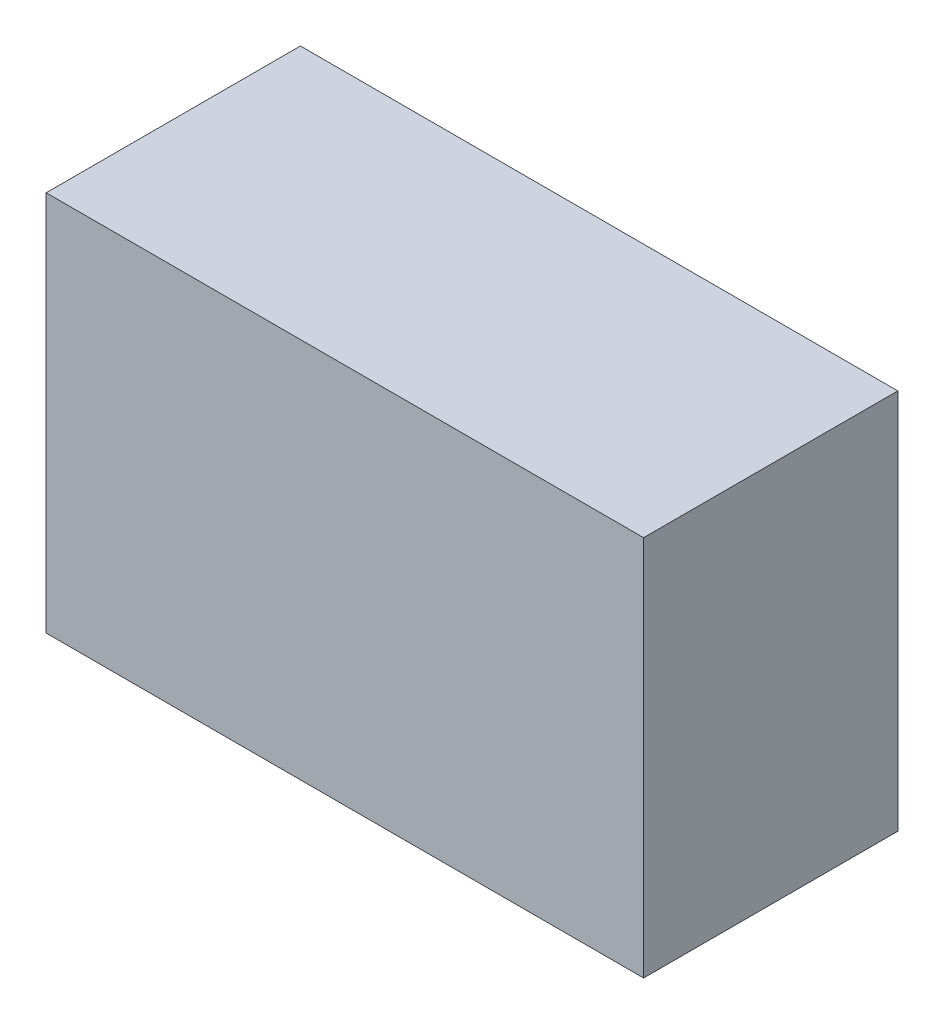
ISO-10303-21;
HEADER;
FILE_DESCRIPTION(('STEP AP214'),'2;1');
FILE_NAME('part.step','',(''),(''),'','','');
FILE_SCHEMA(('AUTOMOTIVE_DESIGN { 1 0 10303 214 1 1 1 1 }'));
ENDSEC;
DATA;
#1=APPLICATION_CONTEXT('core data for automotive mechanical design processes');
#2=APPLICATION_PROTOCOL_DEFINITION('international standard','automotive_design',2000,#1);
#3=PRODUCT_CONTEXT('',#1,'mechanical');
#4=PRODUCT('Part','Part','',(#3));
#5=PRODUCT_RELATED_PRODUCT_CATEGORY('part','',(#4));
#6=PRODUCT_DEFINITION_FORMATION('','',#4);
#7=PRODUCT_DEFINITION_CONTEXT('part definition',#1,'design');
#8=PRODUCT_DEFINITION('design','',#6,#7);
#9=PRODUCT_DEFINITION_SHAPE('','',#8);
#10=(LENGTH_UNIT() NAMED_UNIT(*) SI_UNIT(.MILLI.,.METRE.));
#11=(NAMED_UNIT(*) PLANE_ANGLE_UNIT() SI_UNIT($,.RADIAN.));
#12=(NAMED_UNIT(*) SI_UNIT($,.STERADIAN.) SOLID_ANGLE_UNIT());
#13=UNCERTAINTY_MEASURE_WITH_UNIT(LENGTH_MEASURE(1.E-05),#10,'distance_accuracy_value','');
#14=(GEOMETRIC_REPRESENTATION_CONTEXT(3) GLOBAL_UNCERTAINTY_ASSIGNED_CONTEXT((#13)) GLOBAL_UNIT_ASSIGNED_CONTEXT((#10,
#11,#12)) REPRESENTATION_CONTEXT('',''));
#15=CARTESIAN_POINT('',(0.,0.,0.));
#16=DIRECTION('',(0.,0.,1.));
#17=DIRECTION('',(1.,0.,0.));
#18=AXIS2_PLACEMENT_3D('',#15,#16,#17);
#19=CARTESIAN_POINT('',(0.5969,-0.38099746,0.508));
#20=DIRECTION('',(0.,0.,1.));
#21=DIRECTION('',(1.,0.,0.));
#22=AXIS2_PLACEMENT_3D('',#19,#20,#21);
#23=PLANE('',#22);
#24=DIRECTION('',(0.,1.,0.));
#25=VECTOR('',#24,1.);
#26=CARTESIAN_POINT('',(-0.59689746,-0.381,0.508));
#27=LINE('',#26,#25);
#28=CARTESIAN_POINT('',(-0.59689746,-0.380999999999999,0.508));
#29=VERTEX_POINT('',#28);
#30=CARTESIAN_POINT('',(-0.59689746,0.38100127,0.508));
#31=VERTEX_POINT('',#30);
#32=EDGE_CURVE('E53',#29,#31,#27,.T.);
#33=ORIENTED_EDGE('',*,*,#32,.F.);
#34=DIRECTION('',(0.999999999997737,2.12766409889144E-06,0.));
#35=VECTOR('',#34,1.);
#36=CARTESIAN_POINT('',(0.5969,-0.38099746,0.508));
#37=LINE('',#36,#35);
#38=CARTESIAN_POINT('',(0.5969,-0.380998095,0.508));
#39=VERTEX_POINT('',#38);
#40=EDGE_CURVE('E68',#39,#29,#37,.F.);
#41=ORIENTED_EDGE('',*,*,#40,.F.);
#42=DIRECTION('',(0.,1.,0.));
#43=VECTOR('',#42,1.);
#44=CARTESIAN_POINT('',(0.5969,0.38100254,0.508));
#45=LINE('',#44,#43);
#46=CARTESIAN_POINT('',(0.5969,0.381002539999999,0.508));
#47=VERTEX_POINT('',#46);
#48=EDGE_CURVE('E20',#47,#39,#45,.F.);
#49=ORIENTED_EDGE('',*,*,#48,.F.);
#50=DIRECTION('',(-0.999999999997737,-2.12766409889144E-06,0.));
#51=VECTOR('',#50,1.);
#52=CARTESIAN_POINT('',(-0.59689746,0.381,0.508));
#53=LINE('',#52,#51);
#54=EDGE_CURVE('E58',#31,#47,#53,.F.);
#55=ORIENTED_EDGE('',*,*,#54,.F.);
#56=EDGE_LOOP('',(#33,#41,#49,#55));
#57=FACE_BOUND('',#56,.T.);
#58=ADVANCED_FACE('F17',(#57),#23,.T.);
#59=CARTESIAN_POINT('',(0.5969,0.38100254,0.));
#60=DIRECTION('',(1.,0.,0.));
#61=DIRECTION('',(0.,0.,-1.));
#62=AXIS2_PLACEMENT_3D('',#59,#60,#61);
#63=PLANE('',#62);
#64=DIRECTION('',(0.,0.,1.));
#65=VECTOR('',#64,1.);
#66=CARTESIAN_POINT('',(0.5969,-0.38099746,0.));
#67=LINE('',#66,#65);
#68=CARTESIAN_POINT('',(0.5969,-0.380998095,0.));
#69=VERTEX_POINT('',#68);
#70=EDGE_CURVE('E79',#69,#39,#67,.T.);
#71=ORIENTED_EDGE('',*,*,#70,.F.);
#72=DIRECTION('',(0.,1.,0.));
#73=VECTOR('',#72,1.);
#74=CARTESIAN_POINT('',(0.5969,-0.38099746,0.));
#75=LINE('',#74,#73);
#76=CARTESIAN_POINT('',(0.5969,0.381002539999999,0.));
#77=VERTEX_POINT('',#76);
#78=EDGE_CURVE('E74',#69,#77,#75,.T.);
#79=ORIENTED_EDGE('',*,*,#78,.T.);
#80=DIRECTION('',(0.,0.,1.));
#81=VECTOR('',#80,1.);
#82=CARTESIAN_POINT('',(0.5969,0.381002539999997,0.));
#83=LINE('',#82,#81);
#84=EDGE_CURVE('E63',#47,#77,#83,.F.);
#85=ORIENTED_EDGE('',*,*,#84,.F.);
#86=ORIENTED_EDGE('',*,*,#48,.T.);
#87=EDGE_LOOP('',(#71,#79,#85,#86));
#88=FACE_BOUND('',#87,.T.);
#89=ADVANCED_FACE('F73',(#88),#63,.T.);
#90=CARTESIAN_POINT('',(-0.59689746,0.381,0.));
#91=DIRECTION('',(-2.12766409889144E-06,0.999999999997737,0.));
#92=DIRECTION('',(-0.999999999997737,-2.12766409889144E-06,0.));
#93=AXIS2_PLACEMENT_3D('',#90,#91,#92);
#94=PLANE('',#93);
#95=ORIENTED_EDGE('',*,*,#84,.T.);
#96=DIRECTION('',(1.,0.,0.));
#97=VECTOR('',#96,1.);
#98=CARTESIAN_POINT('',(0.5969,0.38100254,0.));
#99=LINE('',#98,#97);
#100=CARTESIAN_POINT('',(-0.59689746,0.381000635,0.));
#101=VERTEX_POINT('',#100);
#102=EDGE_CURVE('E84',#77,#101,#99,.F.);
#103=ORIENTED_EDGE('',*,*,#102,.T.);
#104=DIRECTION('',(0.,0.,1.));
#105=VECTOR('',#104,1.);
#106=CARTESIAN_POINT('',(-0.59689746,0.381,0.));
#107=LINE('',#106,#105);
#108=EDGE_CURVE('E65',#31,#101,#107,.F.);
#109=ORIENTED_EDGE('',*,*,#108,.F.);
#110=ORIENTED_EDGE('',*,*,#54,.T.);
#111=EDGE_LOOP('',(#95,#103,#109,#110));
#112=FACE_BOUND('',#111,.T.);
#113=ADVANCED_FACE('F60',(#112),#94,.T.);
#114=CARTESIAN_POINT('',(-0.59689746,-0.381,0.));
#115=DIRECTION('',(-1.,0.,0.));
#116=DIRECTION('',(0.,0.,1.));
#117=AXIS2_PLACEMENT_3D('',#114,#115,#116);
#118=PLANE('',#117);
#119=ORIENTED_EDGE('',*,*,#108,.T.);
#120=DIRECTION('',(0.,1.,0.));
#121=VECTOR('',#120,1.);
#122=CARTESIAN_POINT('',(-0.59689746,-0.38099746,0.));
#123=LINE('',#122,#121);
#124=CARTESIAN_POINT('',(-0.59689746,-0.380999999999999,0.));
#125=VERTEX_POINT('',#124);
#126=EDGE_CURVE('E26',#101,#125,#123,.F.);
#127=ORIENTED_EDGE('',*,*,#126,.T.);
#128=DIRECTION('',(0.,0.,1.));
#129=VECTOR('',#128,1.);
#130=CARTESIAN_POINT('',(-0.59689746,-0.380999999999997,0.));
#131=LINE('',#130,#129);
#132=EDGE_CURVE('E34',#29,#125,#131,.F.);
#133=ORIENTED_EDGE('',*,*,#132,.F.);
#134=ORIENTED_EDGE('',*,*,#32,.T.);
#135=EDGE_LOOP('',(#119,#127,#133,#134));
#136=FACE_BOUND('',#135,.T.);
#137=ADVANCED_FACE('F88',(#136),#118,.T.);
#138=CARTESIAN_POINT('',(0.5969,-0.38099746,0.));
#139=DIRECTION('',(2.12766409889144E-06,-0.999999999997737,0.));
#140=DIRECTION('',(0.999999999997737,2.12766409889144E-06,0.));
#141=AXIS2_PLACEMENT_3D('',#138,#139,#140);
#142=PLANE('',#141);
#143=ORIENTED_EDGE('',*,*,#132,.T.);
#144=DIRECTION('',(1.,0.,0.));
#145=VECTOR('',#144,1.);
#146=CARTESIAN_POINT('',(0.5969,-0.381,0.));
#147=LINE('',#146,#145);
#148=EDGE_CURVE('E11',#125,#69,#147,.T.);
#149=ORIENTED_EDGE('',*,*,#148,.T.);
#150=ORIENTED_EDGE('',*,*,#70,.T.);
#151=ORIENTED_EDGE('',*,*,#40,.T.);
#152=EDGE_LOOP('',(#143,#149,#150,#151));
#153=FACE_BOUND('',#152,.T.);
#154=ADVANCED_FACE('F91',(#153),#142,.T.);
#155=CARTESIAN_POINT('',(0.5969,-0.38099746,0.));
#156=DIRECTION('',(0.,0.,1.));
#157=DIRECTION('',(1.,0.,0.));
#158=AXIS2_PLACEMENT_3D('',#155,#156,#157);
#159=PLANE('',#158);
#160=ORIENTED_EDGE('',*,*,#126,.F.);
#161=ORIENTED_EDGE('',*,*,#102,.F.);
#162=ORIENTED_EDGE('',*,*,#78,.F.);
#163=ORIENTED_EDGE('',*,*,#148,.F.);
#164=EDGE_LOOP('',(#160,#161,#162,#163));
#165=FACE_BOUND('',#164,.T.);
#166=ADVANCED_FACE('F90',(#165),#159,.F.);
#167=CLOSED_SHELL('',(#58,#89,#113,#137,#154,#166));
#168=MANIFOLD_SOLID_BREP('B1',#167);
#169=ADVANCED_BREP_SHAPE_REPRESENTATION('',(#18,#168),#14);
#170=SHAPE_DEFINITION_REPRESENTATION(#9,#169);
ENDSEC;
END-ISO-10303-21;
